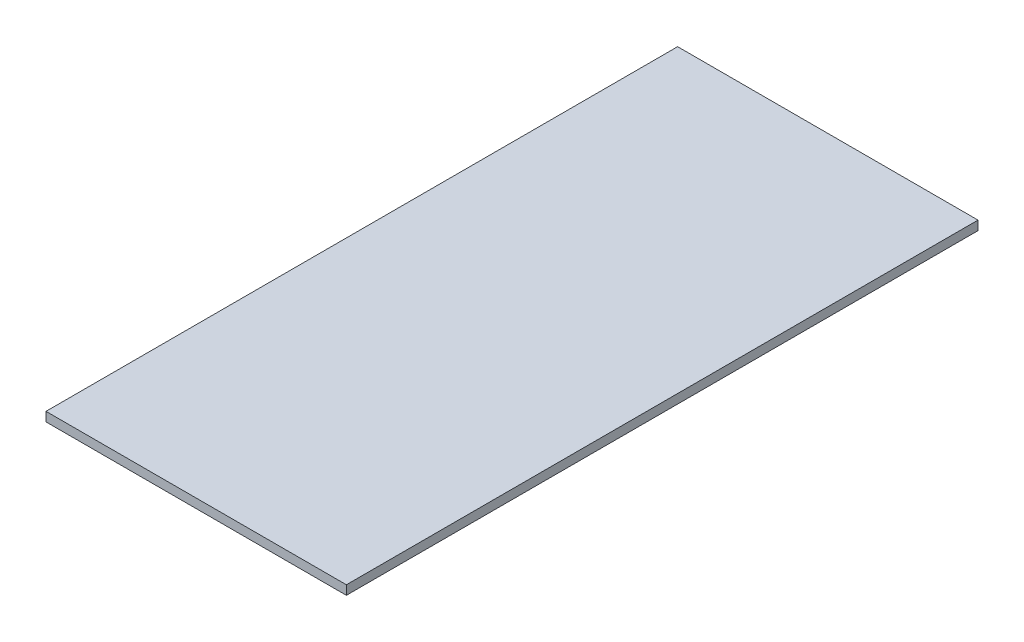
ISO-10303-21;
HEADER;
FILE_DESCRIPTION(('STEP AP214'),'2;1');
FILE_NAME('part.step','',(''),(''),'','','');
FILE_SCHEMA(('AUTOMOTIVE_DESIGN { 1 0 10303 214 1 1 1 1 }'));
ENDSEC;
DATA;
#1=APPLICATION_CONTEXT('core data for automotive mechanical design processes');
#2=APPLICATION_PROTOCOL_DEFINITION('international standard','automotive_design',2000,#1);
#3=PRODUCT_CONTEXT('',#1,'mechanical');
#4=PRODUCT('Part','Part','',(#3));
#5=PRODUCT_RELATED_PRODUCT_CATEGORY('part','',(#4));
#6=PRODUCT_DEFINITION_FORMATION('','',#4);
#7=PRODUCT_DEFINITION_CONTEXT('part definition',#1,'design');
#8=PRODUCT_DEFINITION('design','',#6,#7);
#9=PRODUCT_DEFINITION_SHAPE('','',#8);
#10=(LENGTH_UNIT() NAMED_UNIT(*) SI_UNIT(.MILLI.,.METRE.));
#11=(NAMED_UNIT(*) PLANE_ANGLE_UNIT() SI_UNIT($,.RADIAN.));
#12=(NAMED_UNIT(*) SI_UNIT($,.STERADIAN.) SOLID_ANGLE_UNIT());
#13=UNCERTAINTY_MEASURE_WITH_UNIT(LENGTH_MEASURE(1.E-05),#10,'distance_accuracy_value','');
#14=(GEOMETRIC_REPRESENTATION_CONTEXT(3) GLOBAL_UNCERTAINTY_ASSIGNED_CONTEXT((#13)) GLOBAL_UNIT_ASSIGNED_CONTEXT((#10,
#11,#12)) REPRESENTATION_CONTEXT('',''));
#15=CARTESIAN_POINT('',(0.,0.,0.));
#16=DIRECTION('',(0.,0.,1.));
#17=DIRECTION('',(1.,0.,0.));
#18=AXIS2_PLACEMENT_3D('',#15,#16,#17);
#19=CARTESIAN_POINT('',(270.637,16.51,569.087));
#20=DIRECTION('',(-1.,0.,0.));
#21=DIRECTION('',(0.,0.,1.));
#22=AXIS2_PLACEMENT_3D('',#19,#20,#21);
#23=PLANE('',#22);
#24=DIRECTION('',(0.,0.,-1.));
#25=VECTOR('',#24,1.);
#26=CARTESIAN_POINT('',(270.637,0.,569.087));
#27=LINE('',#26,#25);
#28=CARTESIAN_POINT('',(270.637,0.,569.087));
#29=VERTEX_POINT('',#28);
#30=CARTESIAN_POINT('',(270.637,0.,-569.087));
#31=VERTEX_POINT('',#30);
#32=EDGE_CURVE('E102',#29,#31,#27,.T.);
#33=ORIENTED_EDGE('',*,*,#32,.T.);
#34=DIRECTION('',(0.,-1.,0.));
#35=VECTOR('',#34,1.);
#36=CARTESIAN_POINT('',(270.637,16.51,-569.087));
#37=LINE('',#36,#35);
#38=CARTESIAN_POINT('',(270.637,16.51,-569.087));
#39=VERTEX_POINT('',#38);
#40=EDGE_CURVE('E11',#39,#31,#37,.T.);
#41=ORIENTED_EDGE('',*,*,#40,.F.);
#42=DIRECTION('',(0.,0.,-1.));
#43=VECTOR('',#42,1.);
#44=CARTESIAN_POINT('',(270.637,16.51,569.087));
#45=LINE('',#44,#43);
#46=CARTESIAN_POINT('',(270.637,16.51,569.087));
#47=VERTEX_POINT('',#46);
#48=EDGE_CURVE('E90',#47,#39,#45,.T.);
#49=ORIENTED_EDGE('',*,*,#48,.F.);
#50=DIRECTION('',(0.,-1.,0.));
#51=VECTOR('',#50,1.);
#52=CARTESIAN_POINT('',(270.637,16.51,569.087));
#53=LINE('',#52,#51);
#54=EDGE_CURVE('E98',#47,#29,#53,.T.);
#55=ORIENTED_EDGE('',*,*,#54,.T.);
#56=EDGE_LOOP('',(#33,#41,#49,#55));
#57=FACE_BOUND('',#56,.T.);
#58=ADVANCED_FACE('F39',(#57),#23,.F.);
#59=CARTESIAN_POINT('',(-270.637,16.51,-569.087));
#60=DIRECTION('',(0.,0.,1.));
#61=DIRECTION('',(1.,0.,0.));
#62=AXIS2_PLACEMENT_3D('',#59,#60,#61);
#63=PLANE('',#62);
#64=DIRECTION('',(-1.,0.,0.));
#65=VECTOR('',#64,1.);
#66=CARTESIAN_POINT('',(-270.637,0.,-569.087));
#67=LINE('',#66,#65);
#68=CARTESIAN_POINT('',(-270.637,0.,-569.087));
#69=VERTEX_POINT('',#68);
#70=EDGE_CURVE('E94',#31,#69,#67,.T.);
#71=ORIENTED_EDGE('',*,*,#70,.T.);
#72=DIRECTION('',(0.,-1.,0.));
#73=VECTOR('',#72,1.);
#74=CARTESIAN_POINT('',(-270.637,16.51,-569.087));
#75=LINE('',#74,#73);
#76=CARTESIAN_POINT('',(-270.637,16.51,-569.087));
#77=VERTEX_POINT('',#76);
#78=EDGE_CURVE('E47',#77,#69,#75,.T.);
#79=ORIENTED_EDGE('',*,*,#78,.F.);
#80=DIRECTION('',(-1.,0.,0.));
#81=VECTOR('',#80,1.);
#82=CARTESIAN_POINT('',(-270.637,16.51,-569.087));
#83=LINE('',#82,#81);
#84=EDGE_CURVE('E85',#39,#77,#83,.T.);
#85=ORIENTED_EDGE('',*,*,#84,.F.);
#86=ORIENTED_EDGE('',*,*,#40,.T.);
#87=EDGE_LOOP('',(#71,#79,#85,#86));
#88=FACE_BOUND('',#87,.T.);
#89=ADVANCED_FACE('F93',(#88),#63,.F.);
#90=CARTESIAN_POINT('',(-270.637,16.51,569.087));
#91=DIRECTION('',(1.,0.,0.));
#92=DIRECTION('',(0.,0.,-1.));
#93=AXIS2_PLACEMENT_3D('',#90,#91,#92);
#94=PLANE('',#93);
#95=DIRECTION('',(0.,0.,1.));
#96=VECTOR('',#95,1.);
#97=CARTESIAN_POINT('',(-270.637,0.,569.087));
#98=LINE('',#97,#96);
#99=CARTESIAN_POINT('',(-270.637,0.,569.087));
#100=VERTEX_POINT('',#99);
#101=EDGE_CURVE('E72',#69,#100,#98,.T.);
#102=ORIENTED_EDGE('',*,*,#101,.T.);
#103=DIRECTION('',(0.,-1.,0.));
#104=VECTOR('',#103,1.);
#105=CARTESIAN_POINT('',(-270.637,16.51,569.087));
#106=LINE('',#105,#104);
#107=CARTESIAN_POINT('',(-270.637,16.51,569.087));
#108=VERTEX_POINT('',#107);
#109=EDGE_CURVE('E95',#108,#100,#106,.T.);
#110=ORIENTED_EDGE('',*,*,#109,.F.);
#111=DIRECTION('',(0.,0.,1.));
#112=VECTOR('',#111,1.);
#113=CARTESIAN_POINT('',(-270.637,16.51,569.087));
#114=LINE('',#113,#112);
#115=EDGE_CURVE('E88',#77,#108,#114,.T.);
#116=ORIENTED_EDGE('',*,*,#115,.F.);
#117=ORIENTED_EDGE('',*,*,#78,.T.);
#118=EDGE_LOOP('',(#102,#110,#116,#117));
#119=FACE_BOUND('',#118,.T.);
#120=ADVANCED_FACE('F96',(#119),#94,.F.);
#121=CARTESIAN_POINT('',(-270.637,16.51,569.087));
#122=DIRECTION('',(0.,0.,-1.));
#123=DIRECTION('',(-1.,0.,0.));
#124=AXIS2_PLACEMENT_3D('',#121,#122,#123);
#125=PLANE('',#124);
#126=DIRECTION('',(1.,0.,0.));
#127=VECTOR('',#126,1.);
#128=CARTESIAN_POINT('',(-270.637,0.,569.087));
#129=LINE('',#128,#127);
#130=EDGE_CURVE('E78',#100,#29,#129,.T.);
#131=ORIENTED_EDGE('',*,*,#130,.T.);
#132=ORIENTED_EDGE('',*,*,#54,.F.);
#133=DIRECTION('',(1.,0.,0.));
#134=VECTOR('',#133,1.);
#135=CARTESIAN_POINT('',(-270.637,16.51,569.087));
#136=LINE('',#135,#134);
#137=EDGE_CURVE('E55',#108,#47,#136,.T.);
#138=ORIENTED_EDGE('',*,*,#137,.F.);
#139=ORIENTED_EDGE('',*,*,#109,.T.);
#140=EDGE_LOOP('',(#131,#132,#138,#139));
#141=FACE_BOUND('',#140,.T.);
#142=ADVANCED_FACE('F109',(#141),#125,.F.);
#143=CARTESIAN_POINT('',(0.,16.51,0.));
#144=DIRECTION('',(0.,-1.,0.));
#145=DIRECTION('',(0.,0.,-1.));
#146=AXIS2_PLACEMENT_3D('',#143,#144,#145);
#147=PLANE('',#146);
#148=ORIENTED_EDGE('',*,*,#48,.T.);
#149=ORIENTED_EDGE('',*,*,#84,.T.);
#150=ORIENTED_EDGE('',*,*,#115,.T.);
#151=ORIENTED_EDGE('',*,*,#137,.T.);
#152=EDGE_LOOP('',(#148,#149,#150,#151));
#153=FACE_BOUND('',#152,.T.);
#154=ADVANCED_FACE('F86',(#153),#147,.F.);
#155=CARTESIAN_POINT('',(0.,0.,0.));
#156=DIRECTION('',(0.,-1.,0.));
#157=DIRECTION('',(0.,0.,-1.));
#158=AXIS2_PLACEMENT_3D('',#155,#156,#157);
#159=PLANE('',#158);
#160=ORIENTED_EDGE('',*,*,#32,.F.);
#161=ORIENTED_EDGE('',*,*,#130,.F.);
#162=ORIENTED_EDGE('',*,*,#101,.F.);
#163=ORIENTED_EDGE('',*,*,#70,.F.);
#164=EDGE_LOOP('',(#160,#161,#162,#163));
#165=FACE_BOUND('',#164,.T.);
#166=ADVANCED_FACE('F112',(#165),#159,.T.);
#167=CLOSED_SHELL('',(#58,#89,#120,#142,#154,#166));
#168=MANIFOLD_SOLID_BREP('B2',#167);
#169=ADVANCED_BREP_SHAPE_REPRESENTATION('',(#18,#168),#14);
#170=SHAPE_DEFINITION_REPRESENTATION(#9,#169);
ENDSEC;
END-ISO-10303-21;
